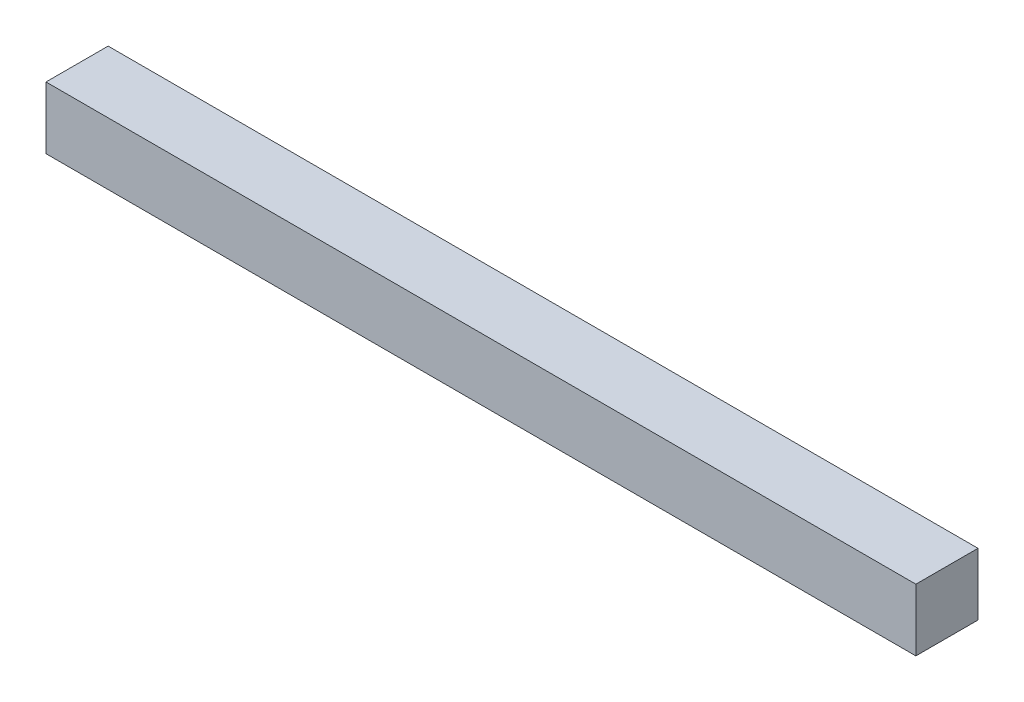
ISO-10303-21;
HEADER;
FILE_DESCRIPTION(('STEP AP214'),'2;1');
FILE_NAME('part.step','',(''),(''),'','','');
FILE_SCHEMA(('AUTOMOTIVE_DESIGN { 1 0 10303 214 1 1 1 1 }'));
ENDSEC;
DATA;
#1=APPLICATION_CONTEXT('core data for automotive mechanical design processes');
#2=APPLICATION_PROTOCOL_DEFINITION('international standard','automotive_design',2000,#1);
#3=PRODUCT_CONTEXT('',#1,'mechanical');
#4=PRODUCT('Part','Part','',(#3));
#5=PRODUCT_RELATED_PRODUCT_CATEGORY('part','',(#4));
#6=PRODUCT_DEFINITION_FORMATION('','',#4);
#7=PRODUCT_DEFINITION_CONTEXT('part definition',#1,'design');
#8=PRODUCT_DEFINITION('design','',#6,#7);
#9=PRODUCT_DEFINITION_SHAPE('','',#8);
#10=(LENGTH_UNIT() NAMED_UNIT(*) SI_UNIT(.MILLI.,.METRE.));
#11=(NAMED_UNIT(*) PLANE_ANGLE_UNIT() SI_UNIT($,.RADIAN.));
#12=(NAMED_UNIT(*) SI_UNIT($,.STERADIAN.) SOLID_ANGLE_UNIT());
#13=UNCERTAINTY_MEASURE_WITH_UNIT(LENGTH_MEASURE(1.E-05),#10,'distance_accuracy_value','');
#14=(GEOMETRIC_REPRESENTATION_CONTEXT(3) GLOBAL_UNCERTAINTY_ASSIGNED_CONTEXT((#13)) GLOBAL_UNIT_ASSIGNED_CONTEXT((#10,
#11,#12)) REPRESENTATION_CONTEXT('',''));
#15=CARTESIAN_POINT('',(0.,0.,0.));
#16=DIRECTION('',(0.,0.,1.));
#17=DIRECTION('',(1.,0.,0.));
#18=AXIS2_PLACEMENT_3D('',#15,#16,#17);
#19=CARTESIAN_POINT('',(44.45,-1.5875,-1.5875));
#20=DIRECTION('',(0.,-1.,0.));
#21=DIRECTION('',(0.,0.,-1.));
#22=AXIS2_PLACEMENT_3D('',#19,#20,#21);
#23=PLANE('',#22);
#24=DIRECTION('',(0.,0.,1.));
#25=VECTOR('',#24,1.);
#26=CARTESIAN_POINT('',(0.,-1.5875,-1.5875));
#27=LINE('',#26,#25);
#28=CARTESIAN_POINT('',(0.,-1.5875,-1.5875));
#29=VERTEX_POINT('',#28);
#30=CARTESIAN_POINT('',(0.,-1.5875,1.5875));
#31=VERTEX_POINT('',#30);
#32=EDGE_CURVE('E110',#29,#31,#27,.T.);
#33=ORIENTED_EDGE('',*,*,#32,.F.);
#34=DIRECTION('',(-1.,0.,0.));
#35=VECTOR('',#34,1.);
#36=CARTESIAN_POINT('',(44.45,-1.5875,-1.5875));
#37=LINE('',#36,#35);
#38=CARTESIAN_POINT('',(44.45,-1.5875,-1.5875));
#39=VERTEX_POINT('',#38);
#40=EDGE_CURVE('E11',#39,#29,#37,.T.);
#41=ORIENTED_EDGE('',*,*,#40,.F.);
#42=DIRECTION('',(0.,0.,1.));
#43=VECTOR('',#42,1.);
#44=CARTESIAN_POINT('',(44.45,-1.5875,-1.5875));
#45=LINE('',#44,#43);
#46=CARTESIAN_POINT('',(44.45,-1.5875,1.5875));
#47=VERTEX_POINT('',#46);
#48=EDGE_CURVE('E103',#39,#47,#45,.T.);
#49=ORIENTED_EDGE('',*,*,#48,.T.);
#50=DIRECTION('',(-1.,0.,0.));
#51=VECTOR('',#50,1.);
#52=CARTESIAN_POINT('',(44.45,-1.5875,1.5875));
#53=LINE('',#52,#51);
#54=EDGE_CURVE('E42',#47,#31,#53,.T.);
#55=ORIENTED_EDGE('',*,*,#54,.T.);
#56=EDGE_LOOP('',(#33,#41,#49,#55));
#57=FACE_BOUND('',#56,.T.);
#58=ADVANCED_FACE('F39',(#57),#23,.T.);
#59=CARTESIAN_POINT('',(44.45,-1.5875,-1.5875));
#60=DIRECTION('',(0.,0.,1.));
#61=DIRECTION('',(1.,0.,0.));
#62=AXIS2_PLACEMENT_3D('',#59,#60,#61);
#63=PLANE('',#62);
#64=DIRECTION('',(0.,1.,0.));
#65=VECTOR('',#64,1.);
#66=CARTESIAN_POINT('',(0.,-1.5875,-1.5875));
#67=LINE('',#66,#65);
#68=CARTESIAN_POINT('',(0.,1.5875,-1.5875));
#69=VERTEX_POINT('',#68);
#70=EDGE_CURVE('E73',#29,#69,#67,.T.);
#71=ORIENTED_EDGE('',*,*,#70,.T.);
#72=DIRECTION('',(-1.,0.,0.));
#73=VECTOR('',#72,1.);
#74=CARTESIAN_POINT('',(44.45,1.5875,-1.5875));
#75=LINE('',#74,#73);
#76=CARTESIAN_POINT('',(44.45,1.5875,-1.5875));
#77=VERTEX_POINT('',#76);
#78=EDGE_CURVE('E49',#77,#69,#75,.T.);
#79=ORIENTED_EDGE('',*,*,#78,.F.);
#80=DIRECTION('',(0.,1.,0.));
#81=VECTOR('',#80,1.);
#82=CARTESIAN_POINT('',(44.45,-1.5875,-1.5875));
#83=LINE('',#82,#81);
#84=EDGE_CURVE('E90',#39,#77,#83,.T.);
#85=ORIENTED_EDGE('',*,*,#84,.F.);
#86=ORIENTED_EDGE('',*,*,#40,.T.);
#87=EDGE_LOOP('',(#71,#79,#85,#86));
#88=FACE_BOUND('',#87,.T.);
#89=ADVANCED_FACE('F126',(#88),#63,.F.);
#90=CARTESIAN_POINT('',(44.45,1.5875,-1.5875));
#91=DIRECTION('',(0.,-1.,0.));
#92=DIRECTION('',(0.,0.,-1.));
#93=AXIS2_PLACEMENT_3D('',#90,#91,#92);
#94=PLANE('',#93);
#95=DIRECTION('',(0.,0.,1.));
#96=VECTOR('',#95,1.);
#97=CARTESIAN_POINT('',(0.,1.5875,-1.5875));
#98=LINE('',#97,#96);
#99=CARTESIAN_POINT('',(0.,1.5875,1.5875));
#100=VERTEX_POINT('',#99);
#101=EDGE_CURVE('E98',#69,#100,#98,.T.);
#102=ORIENTED_EDGE('',*,*,#101,.T.);
#103=DIRECTION('',(-1.,0.,0.));
#104=VECTOR('',#103,1.);
#105=CARTESIAN_POINT('',(44.45,1.5875,1.5875));
#106=LINE('',#105,#104);
#107=CARTESIAN_POINT('',(44.45,1.5875,1.5875));
#108=VERTEX_POINT('',#107);
#109=EDGE_CURVE('E95',#108,#100,#106,.T.);
#110=ORIENTED_EDGE('',*,*,#109,.F.);
#111=DIRECTION('',(0.,0.,1.));
#112=VECTOR('',#111,1.);
#113=CARTESIAN_POINT('',(44.45,1.5875,-1.5875));
#114=LINE('',#113,#112);
#115=EDGE_CURVE('E85',#77,#108,#114,.T.);
#116=ORIENTED_EDGE('',*,*,#115,.F.);
#117=ORIENTED_EDGE('',*,*,#78,.T.);
#118=EDGE_LOOP('',(#102,#110,#116,#117));
#119=FACE_BOUND('',#118,.T.);
#120=ADVANCED_FACE('F96',(#119),#94,.F.);
#121=CARTESIAN_POINT('',(44.45,-1.5875,1.5875));
#122=DIRECTION('',(0.,0.,1.));
#123=DIRECTION('',(1.,0.,0.));
#124=AXIS2_PLACEMENT_3D('',#121,#122,#123);
#125=PLANE('',#124);
#126=DIRECTION('',(0.,1.,0.));
#127=VECTOR('',#126,1.);
#128=CARTESIAN_POINT('',(0.,-1.5875,1.5875));
#129=LINE('',#128,#127);
#130=EDGE_CURVE('E114',#31,#100,#129,.T.);
#131=ORIENTED_EDGE('',*,*,#130,.F.);
#132=ORIENTED_EDGE('',*,*,#54,.F.);
#133=DIRECTION('',(0.,1.,0.));
#134=VECTOR('',#133,1.);
#135=CARTESIAN_POINT('',(44.45,-1.5875,1.5875));
#136=LINE('',#135,#134);
#137=EDGE_CURVE('E89',#47,#108,#136,.T.);
#138=ORIENTED_EDGE('',*,*,#137,.T.);
#139=ORIENTED_EDGE('',*,*,#109,.T.);
#140=EDGE_LOOP('',(#131,#132,#138,#139));
#141=FACE_BOUND('',#140,.T.);
#142=ADVANCED_FACE('F101',(#141),#125,.T.);
#143=CARTESIAN_POINT('',(44.45,0.,0.));
#144=DIRECTION('',(-1.,0.,0.));
#145=DIRECTION('',(0.,0.,1.));
#146=AXIS2_PLACEMENT_3D('',#143,#144,#145);
#147=PLANE('',#146);
#148=ORIENTED_EDGE('',*,*,#48,.F.);
#149=ORIENTED_EDGE('',*,*,#84,.T.);
#150=ORIENTED_EDGE('',*,*,#115,.T.);
#151=ORIENTED_EDGE('',*,*,#137,.F.);
#152=EDGE_LOOP('',(#148,#149,#150,#151));
#153=FACE_BOUND('',#152,.T.);
#154=ADVANCED_FACE('F88',(#153),#147,.F.);
#155=CARTESIAN_POINT('',(0.,0.,0.));
#156=DIRECTION('',(-1.,0.,0.));
#157=DIRECTION('',(0.,0.,1.));
#158=AXIS2_PLACEMENT_3D('',#155,#156,#157);
#159=PLANE('',#158);
#160=ORIENTED_EDGE('',*,*,#32,.T.);
#161=ORIENTED_EDGE('',*,*,#130,.T.);
#162=ORIENTED_EDGE('',*,*,#101,.F.);
#163=ORIENTED_EDGE('',*,*,#70,.F.);
#164=EDGE_LOOP('',(#160,#161,#162,#163));
#165=FACE_BOUND('',#164,.T.);
#166=ADVANCED_FACE('F123',(#165),#159,.T.);
#167=CLOSED_SHELL('',(#58,#89,#120,#142,#154,#166));
#168=MANIFOLD_SOLID_BREP('B2',#167);
#169=ADVANCED_BREP_SHAPE_REPRESENTATION('',(#18,#168),#14);
#170=SHAPE_DEFINITION_REPRESENTATION(#9,#169);
ENDSEC;
END-ISO-10303-21;
